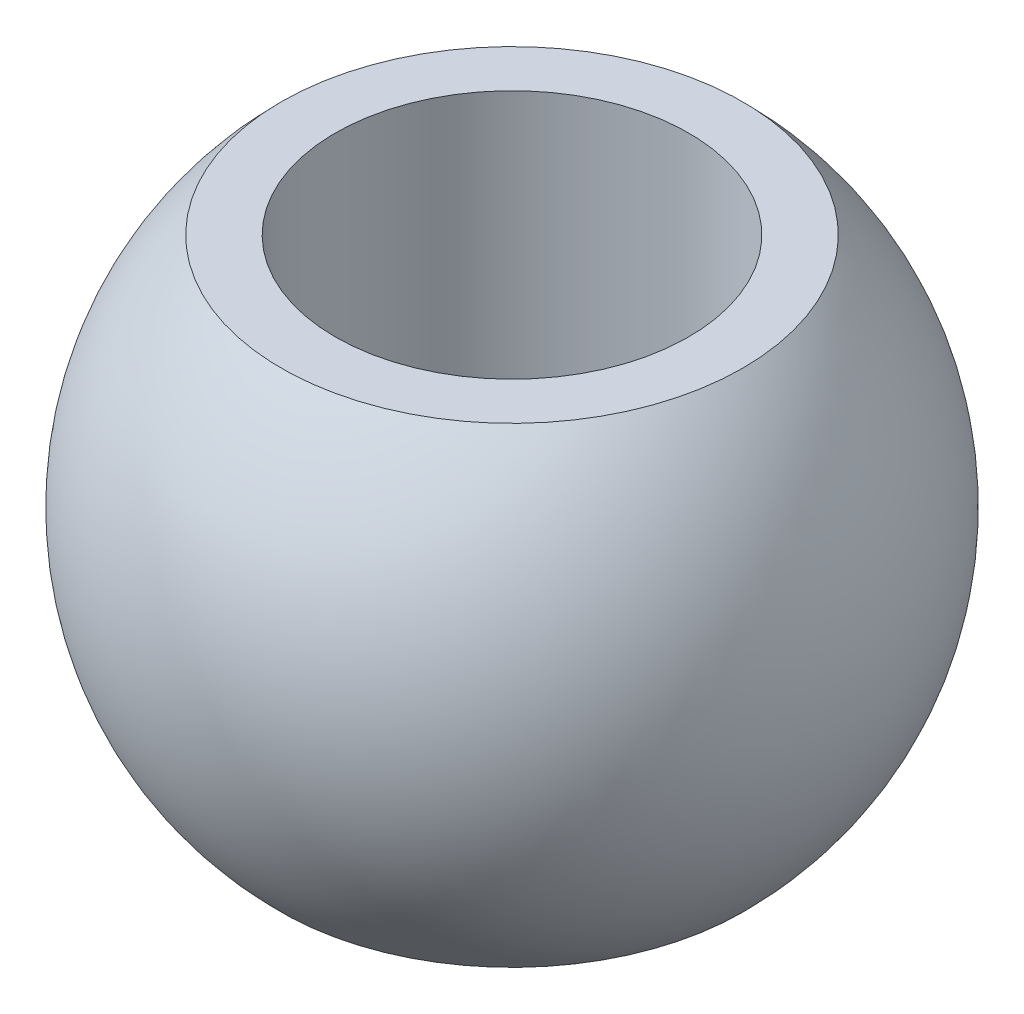
ISO-10303-21;
HEADER;
FILE_DESCRIPTION(('STEP AP214'),'2;1');
FILE_NAME('part.step','',(''),(''),'','','');
FILE_SCHEMA(('AUTOMOTIVE_DESIGN { 1 0 10303 214 1 1 1 1 }'));
ENDSEC;
DATA;
#1=APPLICATION_CONTEXT('core data for automotive mechanical design processes');
#2=APPLICATION_PROTOCOL_DEFINITION('international standard','automotive_design',2000,#1);
#3=PRODUCT_CONTEXT('',#1,'mechanical');
#4=PRODUCT('Part','Part','',(#3));
#5=PRODUCT_RELATED_PRODUCT_CATEGORY('part','',(#4));
#6=PRODUCT_DEFINITION_FORMATION('','',#4);
#7=PRODUCT_DEFINITION_CONTEXT('part definition',#1,'design');
#8=PRODUCT_DEFINITION('design','',#6,#7);
#9=PRODUCT_DEFINITION_SHAPE('','',#8);
#10=(LENGTH_UNIT() NAMED_UNIT(*) SI_UNIT(.MILLI.,.METRE.));
#11=(NAMED_UNIT(*) PLANE_ANGLE_UNIT() SI_UNIT($,.RADIAN.));
#12=(NAMED_UNIT(*) SI_UNIT($,.STERADIAN.) SOLID_ANGLE_UNIT());
#13=UNCERTAINTY_MEASURE_WITH_UNIT(LENGTH_MEASURE(1.E-05),#10,'distance_accuracy_value','');
#14=(GEOMETRIC_REPRESENTATION_CONTEXT(3) GLOBAL_UNCERTAINTY_ASSIGNED_CONTEXT((#13)) GLOBAL_UNIT_ASSIGNED_CONTEXT((#10,
#11,#12)) REPRESENTATION_CONTEXT('',''));
#15=CARTESIAN_POINT('',(0.,0.,0.));
#16=DIRECTION('',(0.,0.,1.));
#17=DIRECTION('',(1.,0.,0.));
#18=AXIS2_PLACEMENT_3D('',#15,#16,#17);
#19=CARTESIAN_POINT('',(0.,-7.76379695062673,0.));
#20=DIRECTION('',(0.,-1.,0.));
#21=DIRECTION('',(1.,0.,0.));
#22=AXIS2_PLACEMENT_3D('',#19,#20,#21);
#23=PLANE('',#22);
#24=CARTESIAN_POINT('',(0.,-7.76379695062673,0.));
#25=DIRECTION('',(0.,1.,0.));
#26=DIRECTION('',(0.,0.,1.));
#27=AXIS2_PLACEMENT_3D('',#24,#25,#26);
#28=CIRCLE('',#27,4.7625);
#29=CARTESIAN_POINT('',(0.,-7.76379695062673,4.7625));
#30=VERTEX_POINT('',#29);
#31=EDGE_CURVE('E44',#30,#30,#28,.T.);
#32=ORIENTED_EDGE('',*,*,#31,.T.);
#33=EDGE_LOOP('',(#32));
#34=FACE_BOUND('',#33,.T.);
#35=CARTESIAN_POINT('',(0.,-7.76379695062673,0.));
#36=DIRECTION('',(0.,-1.,0.));
#37=DIRECTION('',(1.,0.,0.));
#38=AXIS2_PLACEMENT_3D('',#35,#36,#37);
#39=CIRCLE('',#38,6.21943777603732);
#40=CARTESIAN_POINT('',(6.21943777603732,-7.76379695062673,0.));
#41=VERTEX_POINT('',#40);
#42=EDGE_CURVE('E10',#41,#41,#39,.T.);
#43=ORIENTED_EDGE('',*,*,#42,.T.);
#44=EDGE_LOOP('',(#43));
#45=FACE_BOUND('',#44,.T.);
#46=ADVANCED_FACE('F34',(#34,#45),#23,.T.);
#47=CARTESIAN_POINT('',(0.,-1.41379695062673,0.));
#48=DIRECTION('',(0.,-1.,0.));
#49=DIRECTION('',(1.,0.,0.));
#50=AXIS2_PLACEMENT_3D('',#47,#48,#49);
#51=SPHERICAL_SURFACE('',#50,8.88841415832993);
#52=CARTESIAN_POINT('',(0.,4.93620304937327,0.));
#53=DIRECTION('',(0.,-1.,0.));
#54=DIRECTION('',(1.,0.,0.));
#55=AXIS2_PLACEMENT_3D('',#52,#53,#54);
#56=CIRCLE('',#55,6.21943777603732);
#57=CARTESIAN_POINT('',(6.21943777603732,4.93620304937327,0.));
#58=VERTEX_POINT('',#57);
#59=EDGE_CURVE('E40',#58,#58,#56,.T.);
#60=ORIENTED_EDGE('',*,*,#59,.T.);
#61=EDGE_LOOP('',(#60));
#62=FACE_BOUND('',#61,.T.);
#63=ORIENTED_EDGE('',*,*,#42,.F.);
#64=EDGE_LOOP('',(#63));
#65=FACE_BOUND('',#64,.T.);
#66=ADVANCED_FACE('F59',(#62,#65),#51,.T.);
#67=CARTESIAN_POINT('',(0.,4.93620304937327,0.));
#68=DIRECTION('',(0.,-1.,0.));
#69=DIRECTION('',(1.,0.,0.));
#70=AXIS2_PLACEMENT_3D('',#67,#68,#69);
#71=PLANE('',#70);
#72=CARTESIAN_POINT('',(0.,4.93620304937327,0.));
#73=DIRECTION('',(0.,1.,0.));
#74=DIRECTION('',(0.,0.,1.));
#75=AXIS2_PLACEMENT_3D('',#72,#73,#74);
#76=CIRCLE('',#75,4.7625);
#77=CARTESIAN_POINT('',(0.,4.93620304937327,4.7625));
#78=VERTEX_POINT('',#77);
#79=EDGE_CURVE('E48',#78,#78,#76,.T.);
#80=ORIENTED_EDGE('',*,*,#79,.F.);
#81=EDGE_LOOP('',(#80));
#82=FACE_BOUND('',#81,.T.);
#83=ORIENTED_EDGE('',*,*,#59,.F.);
#84=EDGE_LOOP('',(#83));
#85=FACE_BOUND('',#84,.T.);
#86=ADVANCED_FACE('F56',(#82,#85),#71,.F.);
#87=CARTESIAN_POINT('',(0.,-7.76379695062673,0.));
#88=DIRECTION('',(0.,1.,0.));
#89=DIRECTION('',(0.,0.,1.));
#90=AXIS2_PLACEMENT_3D('',#87,#88,#89);
#91=CYLINDRICAL_SURFACE('',#90,4.7625);
#92=ORIENTED_EDGE('',*,*,#31,.F.);
#93=EDGE_LOOP('',(#92));
#94=FACE_BOUND('',#93,.T.);
#95=ORIENTED_EDGE('',*,*,#79,.T.);
#96=EDGE_LOOP('',(#95));
#97=FACE_BOUND('',#96,.T.);
#98=ADVANCED_FACE('F54',(#94,#97),#91,.F.);
#99=CLOSED_SHELL('',(#46,#66,#86,#98));
#100=MANIFOLD_SOLID_BREP('B2',#99);
#101=ADVANCED_BREP_SHAPE_REPRESENTATION('',(#18,#100),#14);
#102=SHAPE_DEFINITION_REPRESENTATION(#9,#101);
ENDSEC;
END-ISO-10303-21;
